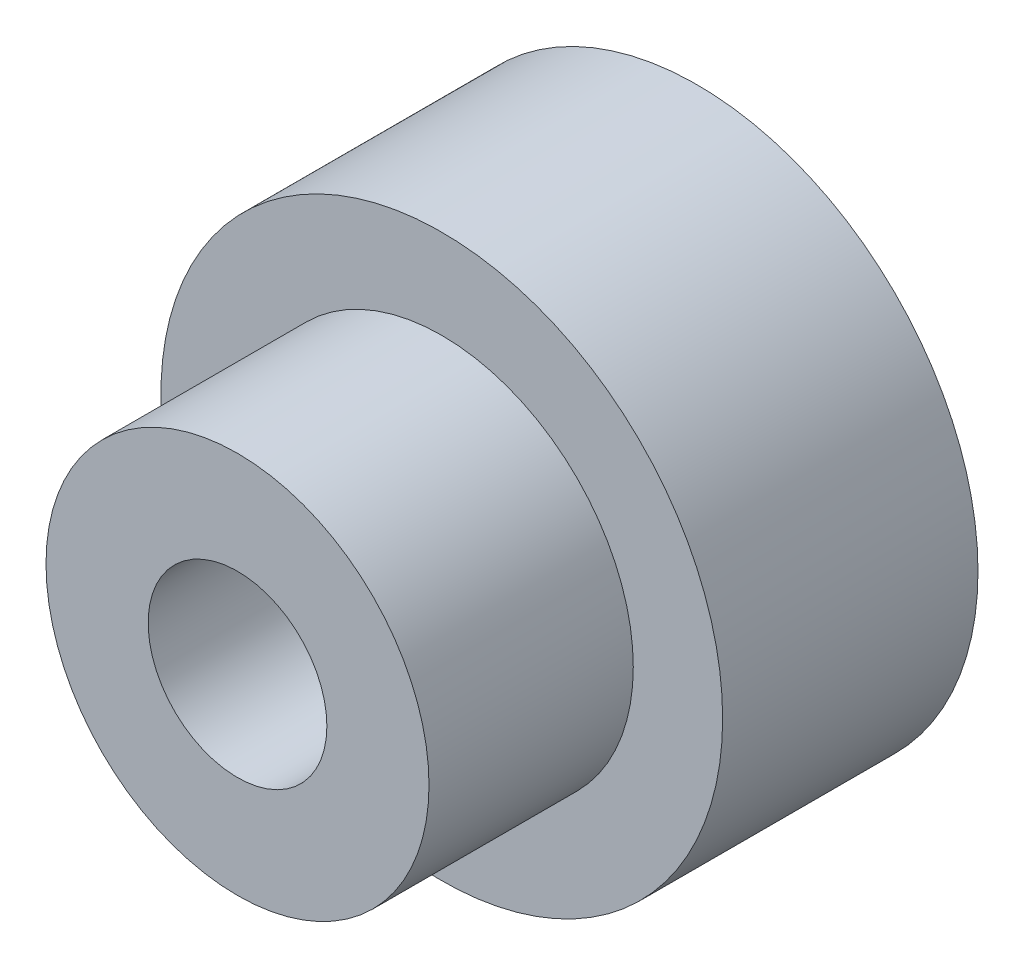
ISO-10303-21;
HEADER;
FILE_DESCRIPTION(('STEP AP214'),'2;1');
FILE_NAME('part.step','',(''),(''),'','','');
FILE_SCHEMA(('AUTOMOTIVE_DESIGN { 1 0 10303 214 1 1 1 1 }'));
ENDSEC;
DATA;
#1=APPLICATION_CONTEXT('core data for automotive mechanical design processes');
#2=APPLICATION_PROTOCOL_DEFINITION('international standard','automotive_design',2000,#1);
#3=PRODUCT_CONTEXT('',#1,'mechanical');
#4=PRODUCT('Part','Part','',(#3));
#5=PRODUCT_RELATED_PRODUCT_CATEGORY('part','',(#4));
#6=PRODUCT_DEFINITION_FORMATION('','',#4);
#7=PRODUCT_DEFINITION_CONTEXT('part definition',#1,'design');
#8=PRODUCT_DEFINITION('design','',#6,#7);
#9=PRODUCT_DEFINITION_SHAPE('','',#8);
#10=(LENGTH_UNIT() NAMED_UNIT(*) SI_UNIT(.MILLI.,.METRE.));
#11=(NAMED_UNIT(*) PLANE_ANGLE_UNIT() SI_UNIT($,.RADIAN.));
#12=(NAMED_UNIT(*) SI_UNIT($,.STERADIAN.) SOLID_ANGLE_UNIT());
#13=UNCERTAINTY_MEASURE_WITH_UNIT(LENGTH_MEASURE(1.E-05),#10,'distance_accuracy_value','');
#14=(GEOMETRIC_REPRESENTATION_CONTEXT(3) GLOBAL_UNCERTAINTY_ASSIGNED_CONTEXT((#13)) GLOBAL_UNIT_ASSIGNED_CONTEXT((#10,
#11,#12)) REPRESENTATION_CONTEXT('',''));
#15=CARTESIAN_POINT('',(0.,0.,0.));
#16=DIRECTION('',(0.,0.,1.));
#17=DIRECTION('',(1.,0.,0.));
#18=AXIS2_PLACEMENT_3D('',#15,#16,#17);
#19=CARTESIAN_POINT('',(0.,0.,10.));
#20=DIRECTION('',(0.,0.,-1.));
#21=DIRECTION('',(-1.,0.,0.));
#22=AXIS2_PLACEMENT_3D('',#19,#20,#21);
#23=CYLINDRICAL_SURFACE('',#22,11.);
#24=CARTESIAN_POINT('',(0.,0.,10.));
#25=DIRECTION('',(0.,0.,1.));
#26=DIRECTION('',(1.,0.,0.));
#27=AXIS2_PLACEMENT_3D('',#24,#25,#26);
#28=CIRCLE('',#27,11.);
#29=CARTESIAN_POINT('',(11.,0.,10.));
#30=VERTEX_POINT('',#29);
#31=EDGE_CURVE('E10',#30,#30,#28,.T.);
#32=ORIENTED_EDGE('',*,*,#31,.F.);
#33=EDGE_LOOP('',(#32));
#34=FACE_BOUND('',#33,.T.);
#35=CARTESIAN_POINT('',(0.,0.,0.));
#36=DIRECTION('',(0.,0.,1.));
#37=DIRECTION('',(1.,0.,0.));
#38=AXIS2_PLACEMENT_3D('',#35,#36,#37);
#39=CIRCLE('',#38,11.);
#40=CARTESIAN_POINT('',(11.,0.,0.));
#41=VERTEX_POINT('',#40);
#42=EDGE_CURVE('E36',#41,#41,#39,.T.);
#43=ORIENTED_EDGE('',*,*,#42,.T.);
#44=EDGE_LOOP('',(#43));
#45=FACE_BOUND('',#44,.T.);
#46=ADVANCED_FACE('F33',(#34,#45),#23,.T.);
#47=CARTESIAN_POINT('',(0.,0.,10.));
#48=DIRECTION('',(0.,0.,1.));
#49=DIRECTION('',(1.,0.,0.));
#50=AXIS2_PLACEMENT_3D('',#47,#48,#49);
#51=PLANE('',#50);
#52=CARTESIAN_POINT('',(0.,0.,10.));
#53=DIRECTION('',(0.,0.,1.));
#54=DIRECTION('',(1.,0.,0.));
#55=AXIS2_PLACEMENT_3D('',#52,#53,#54);
#56=CIRCLE('',#55,7.5);
#57=CARTESIAN_POINT('',(7.5,0.,10.));
#58=VERTEX_POINT('',#57);
#59=EDGE_CURVE('E45',#58,#58,#56,.T.);
#60=ORIENTED_EDGE('',*,*,#59,.F.);
#61=EDGE_LOOP('',(#60));
#62=FACE_BOUND('',#61,.T.);
#63=ORIENTED_EDGE('',*,*,#31,.T.);
#64=EDGE_LOOP('',(#63));
#65=FACE_BOUND('',#64,.T.);
#66=ADVANCED_FACE('F78',(#62,#65),#51,.T.);
#67=CARTESIAN_POINT('',(0.,0.,0.));
#68=DIRECTION('',(0.,0.,1.));
#69=DIRECTION('',(1.,0.,0.));
#70=AXIS2_PLACEMENT_3D('',#67,#68,#69);
#71=PLANE('',#70);
#72=CARTESIAN_POINT('',(0.,0.,0.));
#73=DIRECTION('',(0.,0.,1.));
#74=DIRECTION('',(1.,0.,0.));
#75=AXIS2_PLACEMENT_3D('',#72,#73,#74);
#76=CIRCLE('',#75,3.5);
#77=CARTESIAN_POINT('',(3.5,0.,0.));
#78=VERTEX_POINT('',#77);
#79=EDGE_CURVE('E48',#78,#78,#76,.T.);
#80=ORIENTED_EDGE('',*,*,#79,.T.);
#81=EDGE_LOOP('',(#80));
#82=FACE_BOUND('',#81,.T.);
#83=ORIENTED_EDGE('',*,*,#42,.F.);
#84=EDGE_LOOP('',(#83));
#85=FACE_BOUND('',#84,.T.);
#86=ADVANCED_FACE('F57',(#82,#85),#71,.F.);
#87=CARTESIAN_POINT('',(0.,0.,18.));
#88=DIRECTION('',(0.,0.,-1.));
#89=DIRECTION('',(-1.,0.,0.));
#90=AXIS2_PLACEMENT_3D('',#87,#88,#89);
#91=CYLINDRICAL_SURFACE('',#90,7.5);
#92=CARTESIAN_POINT('',(0.,0.,18.));
#93=DIRECTION('',(0.,0.,1.));
#94=DIRECTION('',(1.,0.,0.));
#95=AXIS2_PLACEMENT_3D('',#92,#93,#94);
#96=CIRCLE('',#95,7.5);
#97=CARTESIAN_POINT('',(7.5,0.,18.));
#98=VERTEX_POINT('',#97);
#99=EDGE_CURVE('E43',#98,#98,#96,.T.);
#100=ORIENTED_EDGE('',*,*,#99,.F.);
#101=EDGE_LOOP('',(#100));
#102=FACE_BOUND('',#101,.T.);
#103=ORIENTED_EDGE('',*,*,#59,.T.);
#104=EDGE_LOOP('',(#103));
#105=FACE_BOUND('',#104,.T.);
#106=ADVANCED_FACE('F69',(#102,#105),#91,.T.);
#107=CARTESIAN_POINT('',(0.,0.,18.));
#108=DIRECTION('',(0.,0.,1.));
#109=DIRECTION('',(1.,0.,0.));
#110=AXIS2_PLACEMENT_3D('',#107,#108,#109);
#111=PLANE('',#110);
#112=CARTESIAN_POINT('',(0.,0.,18.));
#113=DIRECTION('',(0.,0.,1.));
#114=DIRECTION('',(1.,0.,0.));
#115=AXIS2_PLACEMENT_3D('',#112,#113,#114);
#116=CIRCLE('',#115,3.5);
#117=CARTESIAN_POINT('',(3.5,0.,18.));
#118=VERTEX_POINT('',#117);
#119=EDGE_CURVE('E51',#118,#118,#116,.T.);
#120=ORIENTED_EDGE('',*,*,#119,.F.);
#121=EDGE_LOOP('',(#120));
#122=FACE_BOUND('',#121,.T.);
#123=ORIENTED_EDGE('',*,*,#99,.T.);
#124=EDGE_LOOP('',(#123));
#125=FACE_BOUND('',#124,.T.);
#126=ADVANCED_FACE('F63',(#122,#125),#111,.T.);
#127=CARTESIAN_POINT('',(0.,0.,0.));
#128=DIRECTION('',(0.,0.,1.));
#129=DIRECTION('',(1.,0.,0.));
#130=AXIS2_PLACEMENT_3D('',#127,#128,#129);
#131=CYLINDRICAL_SURFACE('',#130,3.5);
#132=ORIENTED_EDGE('',*,*,#79,.F.);
#133=EDGE_LOOP('',(#132));
#134=FACE_BOUND('',#133,.T.);
#135=ORIENTED_EDGE('',*,*,#119,.T.);
#136=EDGE_LOOP('',(#135));
#137=FACE_BOUND('',#136,.T.);
#138=ADVANCED_FACE('F60',(#134,#137),#131,.F.);
#139=CLOSED_SHELL('',(#46,#66,#86,#106,#126,#138));
#140=MANIFOLD_SOLID_BREP('B2',#139);
#141=ADVANCED_BREP_SHAPE_REPRESENTATION('',(#18,#140),#14);
#142=SHAPE_DEFINITION_REPRESENTATION(#9,#141);
ENDSEC;
END-ISO-10303-21;
